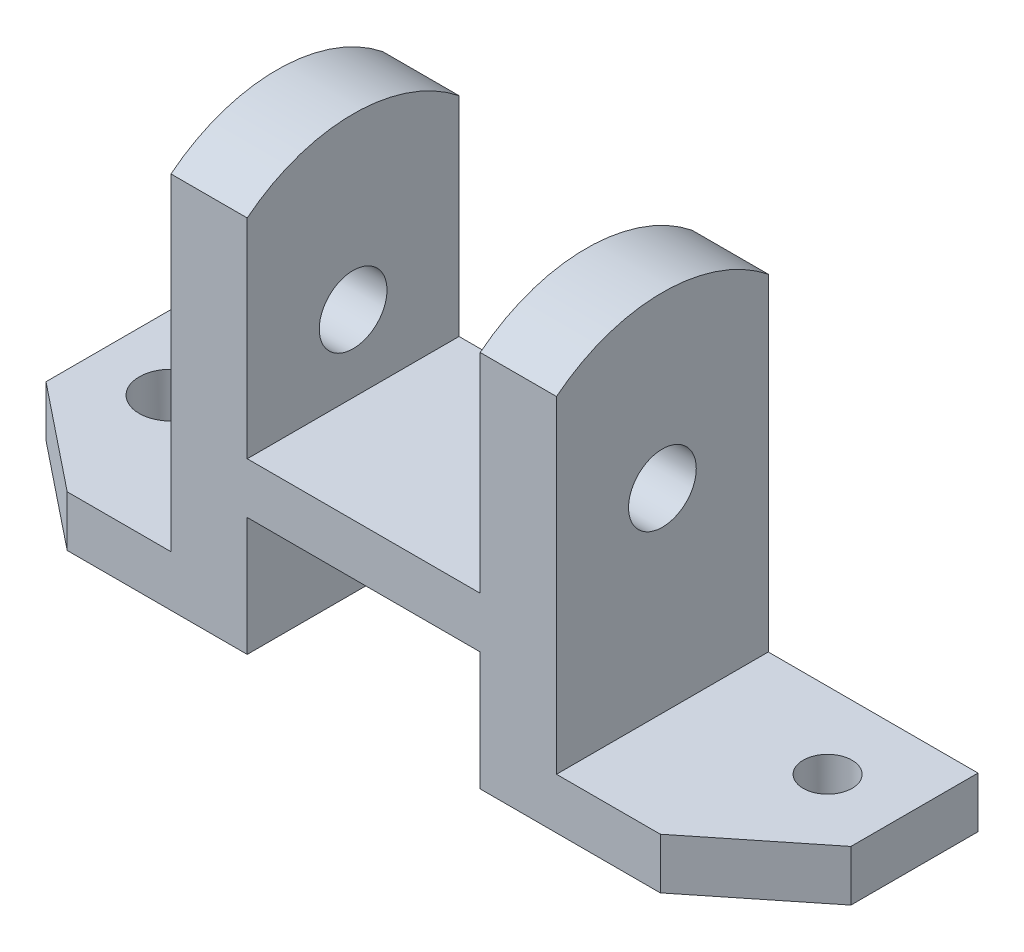
ISO-10303-21;
HEADER;
FILE_DESCRIPTION(('STEP AP214'),'2;1');
FILE_NAME('part.step','',(''),(''),'','','');
FILE_SCHEMA(('AUTOMOTIVE_DESIGN { 1 0 10303 214 1 1 1 1 }'));
ENDSEC;
DATA;
#1=APPLICATION_CONTEXT('core data for automotive mechanical design processes');
#2=APPLICATION_PROTOCOL_DEFINITION('international standard','automotive_design',2000,#1);
#3=PRODUCT_CONTEXT('',#1,'mechanical');
#4=PRODUCT('Part','Part','',(#3));
#5=PRODUCT_RELATED_PRODUCT_CATEGORY('part','',(#4));
#6=PRODUCT_DEFINITION_FORMATION('','',#4);
#7=PRODUCT_DEFINITION_CONTEXT('part definition',#1,'design');
#8=PRODUCT_DEFINITION('design','',#6,#7);
#9=PRODUCT_DEFINITION_SHAPE('','',#8);
#10=(LENGTH_UNIT() NAMED_UNIT(*) SI_UNIT(.MILLI.,.METRE.));
#11=(NAMED_UNIT(*) PLANE_ANGLE_UNIT() SI_UNIT($,.RADIAN.));
#12=(NAMED_UNIT(*) SI_UNIT($,.STERADIAN.) SOLID_ANGLE_UNIT());
#13=UNCERTAINTY_MEASURE_WITH_UNIT(LENGTH_MEASURE(1.E-05),#10,'distance_accuracy_value','');
#14=(GEOMETRIC_REPRESENTATION_CONTEXT(3) GLOBAL_UNCERTAINTY_ASSIGNED_CONTEXT((#13)) GLOBAL_UNIT_ASSIGNED_CONTEXT((#10,
#11,#12)) REPRESENTATION_CONTEXT('',''));
#15=CARTESIAN_POINT('',(0.,0.,0.));
#16=DIRECTION('',(0.,0.,1.));
#17=DIRECTION('',(1.,0.,0.));
#18=AXIS2_PLACEMENT_3D('',#15,#16,#17);
#19=CARTESIAN_POINT('',(0.,-12.,0.));
#20=DIRECTION('',(0.,1.,0.));
#21=DIRECTION('',(0.,0.,1.));
#22=AXIS2_PLACEMENT_3D('',#19,#20,#21);
#23=PLANE('',#22);
#24=DIRECTION('',(1.,0.,0.));
#25=VECTOR('',#24,1.);
#26=CARTESIAN_POINT('',(-27.5,-12.,-11.));
#27=LINE('',#26,#25);
#28=CARTESIAN_POINT('',(-27.5,-12.,-11.));
#29=VERTEX_POINT('',#28);
#30=CARTESIAN_POINT('',(27.5,-12.,-11.));
#31=VERTEX_POINT('',#30);
#32=EDGE_CURVE('E448',#29,#31,#27,.T.);
#33=ORIENTED_EDGE('',*,*,#32,.F.);
#34=DIRECTION('',(0.,0.,1.));
#35=VECTOR('',#34,1.);
#36=CARTESIAN_POINT('',(-27.5,-12.,25.));
#37=LINE('',#36,#35);
#38=CARTESIAN_POINT('',(-27.5,-12.,-25.));
#39=VERTEX_POINT('',#38);
#40=EDGE_CURVE('E213',#39,#29,#37,.T.);
#41=ORIENTED_EDGE('',*,*,#40,.F.);
#42=DIRECTION('',(-1.,0.,0.));
#43=VECTOR('',#42,1.);
#44=CARTESIAN_POINT('',(-45.5,-12.,-25.));
#45=LINE('',#44,#43);
#46=CARTESIAN_POINT('',(27.5,-12.,-25.));
#47=VERTEX_POINT('',#46);
#48=EDGE_CURVE('E245',#47,#39,#45,.T.);
#49=ORIENTED_EDGE('',*,*,#48,.F.);
#50=DIRECTION('',(0.,0.,-1.));
#51=VECTOR('',#50,1.);
#52=CARTESIAN_POINT('',(27.5,-12.,25.));
#53=LINE('',#52,#51);
#54=EDGE_CURVE('E425',#31,#47,#53,.T.);
#55=ORIENTED_EDGE('',*,*,#54,.F.);
#56=EDGE_LOOP('',(#33,#41,#49,#55));
#57=FACE_BOUND('',#56,.T.);
#58=ADVANCED_FACE('F43',(#57),#23,.F.);
#59=DIRECTION('',(-1.,0.,0.));
#60=VECTOR('',#59,1.);
#61=CARTESIAN_POINT('',(-27.5,-12.,-3.));
#62=LINE('',#61,#60);
#63=CARTESIAN_POINT('',(27.5,-12.,-3.));
#64=VERTEX_POINT('',#63);
#65=CARTESIAN_POINT('',(-27.5,-12.,-3.));
#66=VERTEX_POINT('',#65);
#67=EDGE_CURVE('E204',#64,#66,#62,.T.);
#68=ORIENTED_EDGE('',*,*,#67,.F.);
#69=CARTESIAN_POINT('',(27.5,-12.,25.));
#70=VERTEX_POINT('',#69);
#71=EDGE_CURVE('E421',#70,#64,#53,.T.);
#72=ORIENTED_EDGE('',*,*,#71,.F.);
#73=DIRECTION('',(1.,0.,0.));
#74=VECTOR('',#73,1.);
#75=CARTESIAN_POINT('',(-45.5,-12.,25.));
#76=LINE('',#75,#74);
#77=CARTESIAN_POINT('',(-27.5,-12.,25.));
#78=VERTEX_POINT('',#77);
#79=EDGE_CURVE('E248',#78,#70,#76,.T.);
#80=ORIENTED_EDGE('',*,*,#79,.F.);
#81=EDGE_CURVE('E237',#66,#78,#37,.T.);
#82=ORIENTED_EDGE('',*,*,#81,.F.);
#83=EDGE_LOOP('',(#68,#72,#80,#82));
#84=FACE_BOUND('',#83,.T.);
#85=ADVANCED_FACE('F515',(#84),#23,.F.);
#86=CARTESIAN_POINT('',(-27.5,-40.,25.));
#87=DIRECTION('',(-1.,0.,0.));
#88=DIRECTION('',(0.,0.,1.));
#89=AXIS2_PLACEMENT_3D('',#86,#87,#88);
#90=PLANE('',#89);
#91=DIRECTION('',(0.,1.,0.));
#92=VECTOR('',#91,1.);
#93=CARTESIAN_POINT('',(-27.5,-40.,-11.));
#94=LINE('',#93,#92);
#95=CARTESIAN_POINT('',(-27.5,-40.,-11.));
#96=VERTEX_POINT('',#95);
#97=EDGE_CURVE('E197',#96,#29,#94,.T.);
#98=ORIENTED_EDGE('',*,*,#97,.F.);
#99=DIRECTION('',(0.,0.,1.));
#100=VECTOR('',#99,1.);
#101=CARTESIAN_POINT('',(-27.5,-40.,25.));
#102=LINE('',#101,#100);
#103=CARTESIAN_POINT('',(-27.5,-40.,-25.));
#104=VERTEX_POINT('',#103);
#105=EDGE_CURVE('E211',#104,#96,#102,.T.);
#106=ORIENTED_EDGE('',*,*,#105,.F.);
#107=DIRECTION('',(0.,1.,0.));
#108=VECTOR('',#107,1.);
#109=CARTESIAN_POINT('',(-27.5,-40.,-25.));
#110=LINE('',#109,#108);
#111=EDGE_CURVE('E241',#104,#39,#110,.T.);
#112=ORIENTED_EDGE('',*,*,#111,.T.);
#113=ORIENTED_EDGE('',*,*,#40,.T.);
#114=EDGE_LOOP('',(#98,#106,#112,#113));
#115=FACE_BOUND('',#114,.T.);
#116=ADVANCED_FACE('F209',(#115),#90,.F.);
#117=DIRECTION('',(0.,1.,0.));
#118=VECTOR('',#117,1.);
#119=CARTESIAN_POINT('',(-27.5,-40.,-3.));
#120=LINE('',#119,#118);
#121=CARTESIAN_POINT('',(-27.5,-40.,-3.));
#122=VERTEX_POINT('',#121);
#123=EDGE_CURVE('E874',#122,#66,#120,.T.);
#124=ORIENTED_EDGE('',*,*,#123,.T.);
#125=ORIENTED_EDGE('',*,*,#81,.T.);
#126=DIRECTION('',(0.,1.,0.));
#127=VECTOR('',#126,1.);
#128=CARTESIAN_POINT('',(-27.5,-40.,25.));
#129=LINE('',#128,#127);
#130=CARTESIAN_POINT('',(-27.5,-40.,25.));
#131=VERTEX_POINT('',#130);
#132=EDGE_CURVE('E230',#131,#78,#129,.T.);
#133=ORIENTED_EDGE('',*,*,#132,.F.);
#134=EDGE_CURVE('E225',#122,#131,#102,.T.);
#135=ORIENTED_EDGE('',*,*,#134,.F.);
#136=EDGE_LOOP('',(#124,#125,#133,#135));
#137=FACE_BOUND('',#136,.T.);
#138=ADVANCED_FACE('F677',(#137),#90,.F.);
#139=CARTESIAN_POINT('',(27.5,-40.,25.));
#140=DIRECTION('',(1.,0.,0.));
#141=DIRECTION('',(0.,0.,-1.));
#142=AXIS2_PLACEMENT_3D('',#139,#140,#141);
#143=PLANE('',#142);
#144=DIRECTION('',(0.,1.,0.));
#145=VECTOR('',#144,1.);
#146=CARTESIAN_POINT('',(27.5,-40.,-11.));
#147=LINE('',#146,#145);
#148=CARTESIAN_POINT('',(27.5,-40.,-11.));
#149=VERTEX_POINT('',#148);
#150=EDGE_CURVE('E61',#149,#31,#147,.T.);
#151=ORIENTED_EDGE('',*,*,#150,.T.);
#152=ORIENTED_EDGE('',*,*,#54,.T.);
#153=DIRECTION('',(0.,1.,0.));
#154=VECTOR('',#153,1.);
#155=CARTESIAN_POINT('',(27.5,-40.,-25.));
#156=LINE('',#155,#154);
#157=CARTESIAN_POINT('',(27.5,-40.,-25.));
#158=VERTEX_POINT('',#157);
#159=EDGE_CURVE('E416',#158,#47,#156,.T.);
#160=ORIENTED_EDGE('',*,*,#159,.F.);
#161=DIRECTION('',(0.,0.,-1.));
#162=VECTOR('',#161,1.);
#163=CARTESIAN_POINT('',(27.5,-40.,25.));
#164=LINE('',#163,#162);
#165=EDGE_CURVE('E429',#149,#158,#164,.T.);
#166=ORIENTED_EDGE('',*,*,#165,.F.);
#167=EDGE_LOOP('',(#151,#152,#160,#166));
#168=FACE_BOUND('',#167,.T.);
#169=ADVANCED_FACE('F441',(#168),#143,.F.);
#170=DIRECTION('',(0.,1.,0.));
#171=VECTOR('',#170,1.);
#172=CARTESIAN_POINT('',(27.5,-40.,-3.));
#173=LINE('',#172,#171);
#174=CARTESIAN_POINT('',(27.5,-40.,-3.));
#175=VERTEX_POINT('',#174);
#176=EDGE_CURVE('E870',#175,#64,#173,.T.);
#177=ORIENTED_EDGE('',*,*,#176,.F.);
#178=CARTESIAN_POINT('',(27.5,-40.,25.));
#179=VERTEX_POINT('',#178);
#180=EDGE_CURVE('E430',#179,#175,#164,.T.);
#181=ORIENTED_EDGE('',*,*,#180,.F.);
#182=DIRECTION('',(0.,1.,0.));
#183=VECTOR('',#182,1.);
#184=CARTESIAN_POINT('',(27.5,-40.,25.));
#185=LINE('',#184,#183);
#186=EDGE_CURVE('E413',#179,#70,#185,.T.);
#187=ORIENTED_EDGE('',*,*,#186,.T.);
#188=ORIENTED_EDGE('',*,*,#71,.T.);
#189=EDGE_LOOP('',(#177,#181,#187,#188));
#190=FACE_BOUND('',#189,.T.);
#191=ADVANCED_FACE('F693',(#190),#143,.F.);
#192=CARTESIAN_POINT('',(45.5,-12.,-25.));
#193=DIRECTION('',(1.,0.,0.));
#194=DIRECTION('',(0.,0.,-1.));
#195=AXIS2_PLACEMENT_3D('',#192,#193,#194);
#196=PLANE('',#195);
#197=CARTESIAN_POINT('',(45.5,18.,0.));
#198=DIRECTION('',(1.,0.,0.));
#199=DIRECTION('',(0.,0.,-1.));
#200=AXIS2_PLACEMENT_3D('',#197,#198,#199);
#201=CIRCLE('',#200,8.);
#202=CARTESIAN_POINT('',(45.5,18.,-8.));
#203=VERTEX_POINT('',#202);
#204=EDGE_CURVE('E284',#203,#203,#201,.T.);
#205=ORIENTED_EDGE('',*,*,#204,.F.);
#206=EDGE_LOOP('',(#205));
#207=FACE_BOUND('',#206,.T.);
#208=CARTESIAN_POINT('',(45.5,18.,0.));
#209=DIRECTION('',(1.,0.,0.));
#210=DIRECTION('',(0.,0.,-1.));
#211=AXIS2_PLACEMENT_3D('',#208,#209,#210);
#212=CIRCLE('',#211,40.);
#213=CARTESIAN_POINT('',(45.5,49.224989991992,-25.));
#214=VERTEX_POINT('',#213);
#215=CARTESIAN_POINT('',(45.5,49.224989991992,25.));
#216=VERTEX_POINT('',#215);
#217=EDGE_CURVE('E307',#214,#216,#212,.T.);
#218=ORIENTED_EDGE('',*,*,#217,.T.);
#219=DIRECTION('',(0.,1.,0.));
#220=VECTOR('',#219,1.);
#221=CARTESIAN_POINT('',(45.5,-12.,25.));
#222=LINE('',#221,#220);
#223=CARTESIAN_POINT('',(45.5,-28.,25.));
#224=VERTEX_POINT('',#223);
#225=EDGE_CURVE('E11',#224,#216,#222,.T.);
#226=ORIENTED_EDGE('',*,*,#225,.F.);
#227=DIRECTION('',(0.,0.,1.));
#228=VECTOR('',#227,1.);
#229=CARTESIAN_POINT('',(45.5,-28.,25.));
#230=LINE('',#229,#228);
#231=CARTESIAN_POINT('',(45.5,-28.,-25.));
#232=VERTEX_POINT('',#231);
#233=EDGE_CURVE('E392',#232,#224,#230,.T.);
#234=ORIENTED_EDGE('',*,*,#233,.F.);
#235=DIRECTION('',(0.,1.,0.));
#236=VECTOR('',#235,1.);
#237=CARTESIAN_POINT('',(45.5,-12.,-25.));
#238=LINE('',#237,#236);
#239=EDGE_CURVE('E253',#232,#214,#238,.T.);
#240=ORIENTED_EDGE('',*,*,#239,.T.);
#241=EDGE_LOOP('',(#218,#226,#234,#240));
#242=FACE_BOUND('',#241,.T.);
#243=ADVANCED_FACE('F45',(#207,#242),#196,.T.);
#244=CARTESIAN_POINT('',(-45.5,-12.,-25.));
#245=DIRECTION('',(-1.,0.,0.));
#246=DIRECTION('',(0.,0.,1.));
#247=AXIS2_PLACEMENT_3D('',#244,#245,#246);
#248=PLANE('',#247);
#249=CARTESIAN_POINT('',(-45.5,18.,0.));
#250=DIRECTION('',(-1.,0.,0.));
#251=DIRECTION('',(0.,0.,1.));
#252=AXIS2_PLACEMENT_3D('',#249,#250,#251);
#253=CIRCLE('',#252,8.);
#254=CARTESIAN_POINT('',(-45.5,18.,8.));
#255=VERTEX_POINT('',#254);
#256=EDGE_CURVE('E303',#255,#255,#253,.T.);
#257=ORIENTED_EDGE('',*,*,#256,.F.);
#258=EDGE_LOOP('',(#257));
#259=FACE_BOUND('',#258,.T.);
#260=DIRECTION('',(0.,1.,0.));
#261=VECTOR('',#260,1.);
#262=CARTESIAN_POINT('',(-45.5,-12.,25.));
#263=LINE('',#262,#261);
#264=CARTESIAN_POINT('',(-45.5,-28.,25.));
#265=VERTEX_POINT('',#264);
#266=CARTESIAN_POINT('',(-45.5,49.224989991992,25.));
#267=VERTEX_POINT('',#266);
#268=EDGE_CURVE('E53',#265,#267,#263,.T.);
#269=ORIENTED_EDGE('',*,*,#268,.T.);
#270=CARTESIAN_POINT('',(-45.5,18.,0.));
#271=DIRECTION('',(-1.,0.,0.));
#272=DIRECTION('',(0.,0.,1.));
#273=AXIS2_PLACEMENT_3D('',#270,#271,#272);
#274=CIRCLE('',#273,40.);
#275=CARTESIAN_POINT('',(-45.5,49.224989991992,-25.));
#276=VERTEX_POINT('',#275);
#277=EDGE_CURVE('E321',#267,#276,#274,.T.);
#278=ORIENTED_EDGE('',*,*,#277,.T.);
#279=DIRECTION('',(0.,1.,0.));
#280=VECTOR('',#279,1.);
#281=CARTESIAN_POINT('',(-45.5,-12.,-25.));
#282=LINE('',#281,#280);
#283=CARTESIAN_POINT('',(-45.5,-28.,-25.));
#284=VERTEX_POINT('',#283);
#285=EDGE_CURVE('E263',#284,#276,#282,.T.);
#286=ORIENTED_EDGE('',*,*,#285,.F.);
#287=DIRECTION('',(0.,0.,-1.));
#288=VECTOR('',#287,1.);
#289=CARTESIAN_POINT('',(-45.5,-28.,-25.));
#290=LINE('',#289,#288);
#291=EDGE_CURVE('E368',#265,#284,#290,.T.);
#292=ORIENTED_EDGE('',*,*,#291,.F.);
#293=EDGE_LOOP('',(#269,#278,#286,#292));
#294=FACE_BOUND('',#293,.T.);
#295=ADVANCED_FACE('F462',(#259,#294),#248,.T.);
#296=CARTESIAN_POINT('',(-27.5,58.,-25.));
#297=DIRECTION('',(-1.,0.,0.));
#298=DIRECTION('',(0.,0.,1.));
#299=AXIS2_PLACEMENT_3D('',#296,#297,#298);
#300=PLANE('',#299);
#301=CARTESIAN_POINT('',(-27.5,18.,0.));
#302=DIRECTION('',(-1.,0.,0.));
#303=DIRECTION('',(0.,0.,1.));
#304=AXIS2_PLACEMENT_3D('',#301,#302,#303);
#305=CIRCLE('',#304,8.);
#306=CARTESIAN_POINT('',(-27.5,18.,8.));
#307=VERTEX_POINT('',#306);
#308=EDGE_CURVE('E273',#307,#307,#305,.T.);
#309=ORIENTED_EDGE('',*,*,#308,.T.);
#310=EDGE_LOOP('',(#309));
#311=FACE_BOUND('',#310,.T.);
#312=CARTESIAN_POINT('',(-27.5,18.,0.));
#313=DIRECTION('',(-1.,0.,0.));
#314=DIRECTION('',(0.,0.,1.));
#315=AXIS2_PLACEMENT_3D('',#312,#313,#314);
#316=CIRCLE('',#315,40.);
#317=CARTESIAN_POINT('',(-27.5,49.224989991992,25.));
#318=VERTEX_POINT('',#317);
#319=CARTESIAN_POINT('',(-27.5,49.224989991992,-25.));
#320=VERTEX_POINT('',#319);
#321=EDGE_CURVE('E318',#318,#320,#316,.T.);
#322=ORIENTED_EDGE('',*,*,#321,.F.);
#323=DIRECTION('',(0.,-1.,0.));
#324=VECTOR('',#323,1.);
#325=CARTESIAN_POINT('',(-27.5,58.,25.));
#326=LINE('',#325,#324);
#327=CARTESIAN_POINT('',(-27.5,0.,25.));
#328=VERTEX_POINT('',#327);
#329=EDGE_CURVE('E340',#318,#328,#326,.T.);
#330=ORIENTED_EDGE('',*,*,#329,.T.);
#331=DIRECTION('',(0.,0.,-1.));
#332=VECTOR('',#331,1.);
#333=CARTESIAN_POINT('',(-27.5,0.,-25.));
#334=LINE('',#333,#332);
#335=CARTESIAN_POINT('',(-27.5,0.,-25.));
#336=VERTEX_POINT('',#335);
#337=EDGE_CURVE('E333',#328,#336,#334,.T.);
#338=ORIENTED_EDGE('',*,*,#337,.T.);
#339=DIRECTION('',(0.,-1.,0.));
#340=VECTOR('',#339,1.);
#341=CARTESIAN_POINT('',(-27.5,58.,-25.));
#342=LINE('',#341,#340);
#343=EDGE_CURVE('E337',#320,#336,#342,.T.);
#344=ORIENTED_EDGE('',*,*,#343,.F.);
#345=EDGE_LOOP('',(#322,#330,#338,#344));
#346=FACE_BOUND('',#345,.T.);
#347=ADVANCED_FACE('F501',(#311,#346),#300,.F.);
#348=CARTESIAN_POINT('',(27.5,58.,-25.));
#349=DIRECTION('',(1.,0.,0.));
#350=DIRECTION('',(0.,0.,-1.));
#351=AXIS2_PLACEMENT_3D('',#348,#349,#350);
#352=PLANE('',#351);
#353=CARTESIAN_POINT('',(27.5,18.,0.));
#354=DIRECTION('',(1.,0.,0.));
#355=DIRECTION('',(0.,0.,-1.));
#356=AXIS2_PLACEMENT_3D('',#353,#354,#355);
#357=CIRCLE('',#356,8.);
#358=CARTESIAN_POINT('',(27.5,18.,-8.));
#359=VERTEX_POINT('',#358);
#360=EDGE_CURVE('E270',#359,#359,#357,.T.);
#361=ORIENTED_EDGE('',*,*,#360,.T.);
#362=EDGE_LOOP('',(#361));
#363=FACE_BOUND('',#362,.T.);
#364=DIRECTION('',(0.,-1.,0.));
#365=VECTOR('',#364,1.);
#366=CARTESIAN_POINT('',(27.5,58.,25.));
#367=LINE('',#366,#365);
#368=CARTESIAN_POINT('',(27.5,49.224989991992,25.));
#369=VERTEX_POINT('',#368);
#370=CARTESIAN_POINT('',(27.5,0.,25.));
#371=VERTEX_POINT('',#370);
#372=EDGE_CURVE('E327',#369,#371,#367,.T.);
#373=ORIENTED_EDGE('',*,*,#372,.F.);
#374=CARTESIAN_POINT('',(27.5,18.,0.));
#375=DIRECTION('',(1.,0.,0.));
#376=DIRECTION('',(0.,0.,-1.));
#377=AXIS2_PLACEMENT_3D('',#374,#375,#376);
#378=CIRCLE('',#377,40.);
#379=CARTESIAN_POINT('',(27.5,49.224989991992,-25.));
#380=VERTEX_POINT('',#379);
#381=EDGE_CURVE('E315',#380,#369,#378,.T.);
#382=ORIENTED_EDGE('',*,*,#381,.F.);
#383=DIRECTION('',(0.,-1.,0.));
#384=VECTOR('',#383,1.);
#385=CARTESIAN_POINT('',(27.5,58.,-25.));
#386=LINE('',#385,#384);
#387=CARTESIAN_POINT('',(27.5,0.,-25.));
#388=VERTEX_POINT('',#387);
#389=EDGE_CURVE('E69',#380,#388,#386,.T.);
#390=ORIENTED_EDGE('',*,*,#389,.T.);
#391=DIRECTION('',(0.,0.,1.));
#392=VECTOR('',#391,1.);
#393=CARTESIAN_POINT('',(27.5,0.,-25.));
#394=LINE('',#393,#392);
#395=EDGE_CURVE('E330',#388,#371,#394,.T.);
#396=ORIENTED_EDGE('',*,*,#395,.T.);
#397=EDGE_LOOP('',(#373,#382,#390,#396));
#398=FACE_BOUND('',#397,.T.);
#399=ADVANCED_FACE('F495',(#363,#398),#352,.F.);
#400=CARTESIAN_POINT('',(-45.5,-12.,25.));
#401=DIRECTION('',(0.,0.,1.));
#402=DIRECTION('',(1.,0.,0.));
#403=AXIS2_PLACEMENT_3D('',#400,#401,#402);
#404=PLANE('',#403);
#405=ORIENTED_EDGE('',*,*,#225,.T.);
#406=DIRECTION('',(1.,0.,0.));
#407=VECTOR('',#406,1.);
#408=CARTESIAN_POINT('',(-95.,49.224989991992,25.));
#409=LINE('',#408,#407);
#410=EDGE_CURVE('E293',#369,#216,#409,.T.);
#411=ORIENTED_EDGE('',*,*,#410,.F.);
#412=ORIENTED_EDGE('',*,*,#372,.T.);
#413=DIRECTION('',(1.,0.,0.));
#414=VECTOR('',#413,1.);
#415=CARTESIAN_POINT('',(-45.5,0.,25.));
#416=LINE('',#415,#414);
#417=EDGE_CURVE('E249',#328,#371,#416,.T.);
#418=ORIENTED_EDGE('',*,*,#417,.F.);
#419=ORIENTED_EDGE('',*,*,#329,.F.);
#420=EDGE_CURVE('E274',#267,#318,#409,.T.);
#421=ORIENTED_EDGE('',*,*,#420,.F.);
#422=ORIENTED_EDGE('',*,*,#268,.F.);
#423=DIRECTION('',(1.,0.,0.));
#424=VECTOR('',#423,1.);
#425=CARTESIAN_POINT('',(-95.,-28.,25.));
#426=LINE('',#425,#424);
#427=CARTESIAN_POINT('',(-70.,-28.,25.));
#428=VERTEX_POINT('',#427);
#429=EDGE_CURVE('E389',#428,#265,#426,.T.);
#430=ORIENTED_EDGE('',*,*,#429,.F.);
#431=DIRECTION('',(0.,1.,0.));
#432=VECTOR('',#431,1.);
#433=CARTESIAN_POINT('',(-70.,-40.,25.));
#434=LINE('',#433,#432);
#435=CARTESIAN_POINT('',(-70.,-40.,25.));
#436=VERTEX_POINT('',#435);
#437=EDGE_CURVE('E347',#436,#428,#434,.T.);
#438=ORIENTED_EDGE('',*,*,#437,.F.);
#439=DIRECTION('',(-1.,0.,0.));
#440=VECTOR('',#439,1.);
#441=CARTESIAN_POINT('',(-45.5,-40.,25.));
#442=LINE('',#441,#440);
#443=EDGE_CURVE('E224',#131,#436,#442,.T.);
#444=ORIENTED_EDGE('',*,*,#443,.F.);
#445=ORIENTED_EDGE('',*,*,#132,.T.);
#446=ORIENTED_EDGE('',*,*,#79,.T.);
#447=ORIENTED_EDGE('',*,*,#186,.F.);
#448=DIRECTION('',(-1.,0.,0.));
#449=VECTOR('',#448,1.);
#450=CARTESIAN_POINT('',(45.5,-40.,25.));
#451=LINE('',#450,#449);
#452=CARTESIAN_POINT('',(70.,-40.,25.));
#453=VERTEX_POINT('',#452);
#454=EDGE_CURVE('E433',#453,#179,#451,.T.);
#455=ORIENTED_EDGE('',*,*,#454,.F.);
#456=DIRECTION('',(0.,1.,0.));
#457=VECTOR('',#456,1.);
#458=CARTESIAN_POINT('',(70.,-40.,25.));
#459=LINE('',#458,#457);
#460=CARTESIAN_POINT('',(70.,-28.,25.));
#461=VERTEX_POINT('',#460);
#462=EDGE_CURVE('E364',#453,#461,#459,.T.);
#463=ORIENTED_EDGE('',*,*,#462,.T.);
#464=DIRECTION('',(-1.,0.,0.));
#465=VECTOR('',#464,1.);
#466=CARTESIAN_POINT('',(95.,-28.,25.));
#467=LINE('',#466,#465);
#468=EDGE_CURVE('E403',#461,#224,#467,.T.);
#469=ORIENTED_EDGE('',*,*,#468,.T.);
#470=EDGE_LOOP('',(#405,#411,#412,#418,#419,#421,#422,#430,#438,#444,#445,#446,#447,#455,#463,#469));
#471=FACE_BOUND('',#470,.T.);
#472=ADVANCED_FACE('F470',(#471),#404,.T.);
#473=CARTESIAN_POINT('',(-45.5,-12.,-25.));
#474=DIRECTION('',(0.,0.,-1.));
#475=DIRECTION('',(-1.,0.,0.));
#476=AXIS2_PLACEMENT_3D('',#473,#474,#475);
#477=PLANE('',#476);
#478=ORIENTED_EDGE('',*,*,#285,.T.);
#479=DIRECTION('',(1.,0.,0.));
#480=VECTOR('',#479,1.);
#481=CARTESIAN_POINT('',(-95.,49.224989991992,-25.));
#482=LINE('',#481,#480);
#483=EDGE_CURVE('E314',#276,#320,#482,.T.);
#484=ORIENTED_EDGE('',*,*,#483,.T.);
#485=ORIENTED_EDGE('',*,*,#343,.T.);
#486=DIRECTION('',(-1.,0.,0.));
#487=VECTOR('',#486,1.);
#488=CARTESIAN_POINT('',(-45.5,0.,-25.));
#489=LINE('',#488,#487);
#490=EDGE_CURVE('E244',#388,#336,#489,.T.);
#491=ORIENTED_EDGE('',*,*,#490,.F.);
#492=ORIENTED_EDGE('',*,*,#389,.F.);
#493=EDGE_CURVE('E310',#380,#214,#482,.T.);
#494=ORIENTED_EDGE('',*,*,#493,.T.);
#495=ORIENTED_EDGE('',*,*,#239,.F.);
#496=DIRECTION('',(-1.,0.,0.));
#497=VECTOR('',#496,1.);
#498=CARTESIAN_POINT('',(95.,-28.,-25.));
#499=LINE('',#498,#497);
#500=CARTESIAN_POINT('',(95.,-28.,-25.));
#501=VERTEX_POINT('',#500);
#502=EDGE_CURVE('E409',#501,#232,#499,.T.);
#503=ORIENTED_EDGE('',*,*,#502,.F.);
#504=DIRECTION('',(0.,1.,0.));
#505=VECTOR('',#504,1.);
#506=CARTESIAN_POINT('',(95.,-40.,-25.));
#507=LINE('',#506,#505);
#508=CARTESIAN_POINT('',(95.,-40.,-25.));
#509=VERTEX_POINT('',#508);
#510=EDGE_CURVE('E396',#509,#501,#507,.T.);
#511=ORIENTED_EDGE('',*,*,#510,.F.);
#512=DIRECTION('',(1.,0.,0.));
#513=VECTOR('',#512,1.);
#514=CARTESIAN_POINT('',(45.5,-40.,-25.));
#515=LINE('',#514,#513);
#516=EDGE_CURVE('E420',#158,#509,#515,.T.);
#517=ORIENTED_EDGE('',*,*,#516,.F.);
#518=ORIENTED_EDGE('',*,*,#159,.T.);
#519=ORIENTED_EDGE('',*,*,#48,.T.);
#520=ORIENTED_EDGE('',*,*,#111,.F.);
#521=DIRECTION('',(1.,0.,0.));
#522=VECTOR('',#521,1.);
#523=CARTESIAN_POINT('',(-45.5,-40.,-25.));
#524=LINE('',#523,#522);
#525=CARTESIAN_POINT('',(-95.,-40.,-25.));
#526=VERTEX_POINT('',#525);
#527=EDGE_CURVE('E221',#526,#104,#524,.T.);
#528=ORIENTED_EDGE('',*,*,#527,.F.);
#529=DIRECTION('',(0.,-1.,0.));
#530=VECTOR('',#529,1.);
#531=CARTESIAN_POINT('',(-95.,-40.,-25.));
#532=LINE('',#531,#530);
#533=CARTESIAN_POINT('',(-95.,-28.,-25.));
#534=VERTEX_POINT('',#533);
#535=EDGE_CURVE('E371',#534,#526,#532,.T.);
#536=ORIENTED_EDGE('',*,*,#535,.F.);
#537=DIRECTION('',(1.,0.,0.));
#538=VECTOR('',#537,1.);
#539=CARTESIAN_POINT('',(-95.,-28.,-25.));
#540=LINE('',#539,#538);
#541=EDGE_CURVE('E382',#534,#284,#540,.T.);
#542=ORIENTED_EDGE('',*,*,#541,.T.);
#543=EDGE_LOOP('',(#478,#484,#485,#491,#492,#494,#495,#503,#511,#517,#518,#519,#520,#528,#536,#542));
#544=FACE_BOUND('',#543,.T.);
#545=ADVANCED_FACE('F446',(#544),#477,.T.);
#546=CARTESIAN_POINT('',(0.,0.,0.));
#547=DIRECTION('',(0.,1.,0.));
#548=DIRECTION('',(0.,0.,1.));
#549=AXIS2_PLACEMENT_3D('',#546,#547,#548);
#550=PLANE('',#549);
#551=ORIENTED_EDGE('',*,*,#417,.T.);
#552=ORIENTED_EDGE('',*,*,#395,.F.);
#553=ORIENTED_EDGE('',*,*,#490,.T.);
#554=ORIENTED_EDGE('',*,*,#337,.F.);
#555=EDGE_LOOP('',(#551,#552,#553,#554));
#556=FACE_BOUND('',#555,.T.);
#557=ADVANCED_FACE('F498',(#556),#550,.T.);
#558=CARTESIAN_POINT('',(0.,-40.,0.));
#559=DIRECTION('',(0.,-1.,0.));
#560=DIRECTION('',(0.,0.,-1.));
#561=AXIS2_PLACEMENT_3D('',#558,#559,#560);
#562=PLANE('',#561);
#563=CARTESIAN_POINT('',(-77.5,-40.,-7.));
#564=DIRECTION('',(0.,1.,0.));
#565=DIRECTION('',(0.,0.,1.));
#566=AXIS2_PLACEMENT_3D('',#563,#564,#565);
#567=CIRCLE('',#566,7.5);
#568=CARTESIAN_POINT('',(-77.5,-40.,0.5));
#569=VERTEX_POINT('',#568);
#570=EDGE_CURVE('E215',#569,#569,#567,.T.);
#571=ORIENTED_EDGE('',*,*,#570,.T.);
#572=EDGE_LOOP('',(#571));
#573=FACE_BOUND('',#572,.T.);
#574=DIRECTION('',(-0.78086880944303,0.,-0.624695047554424));
#575=VECTOR('',#574,1.);
#576=CARTESIAN_POINT('',(-95.,-40.,5.));
#577=LINE('',#576,#575);
#578=CARTESIAN_POINT('',(-95.,-40.,5.));
#579=VERTEX_POINT('',#578);
#580=EDGE_CURVE('E344',#436,#579,#577,.T.);
#581=ORIENTED_EDGE('',*,*,#580,.T.);
#582=DIRECTION('',(0.,0.,1.));
#583=VECTOR('',#582,1.);
#584=CARTESIAN_POINT('',(-95.,-40.,-25.));
#585=LINE('',#584,#583);
#586=EDGE_CURVE('E375',#526,#579,#585,.T.);
#587=ORIENTED_EDGE('',*,*,#586,.F.);
#588=ORIENTED_EDGE('',*,*,#527,.T.);
#589=ORIENTED_EDGE('',*,*,#105,.T.);
#590=DIRECTION('',(1.,0.,0.));
#591=VECTOR('',#590,1.);
#592=CARTESIAN_POINT('',(-27.5,-40.,-11.));
#593=LINE('',#592,#591);
#594=EDGE_CURVE('E194',#96,#149,#593,.T.);
#595=ORIENTED_EDGE('',*,*,#594,.T.);
#596=ORIENTED_EDGE('',*,*,#165,.T.);
#597=ORIENTED_EDGE('',*,*,#516,.T.);
#598=DIRECTION('',(0.,0.,-1.));
#599=VECTOR('',#598,1.);
#600=CARTESIAN_POINT('',(95.,-40.,25.));
#601=LINE('',#600,#599);
#602=CARTESIAN_POINT('',(95.,-40.,5.));
#603=VERTEX_POINT('',#602);
#604=EDGE_CURVE('E393',#603,#509,#601,.T.);
#605=ORIENTED_EDGE('',*,*,#604,.F.);
#606=DIRECTION('',(-0.78086880944303,0.,0.624695047554424));
#607=VECTOR('',#606,1.);
#608=CARTESIAN_POINT('',(95.,-40.,5.));
#609=LINE('',#608,#607);
#610=EDGE_CURVE('E357',#603,#453,#609,.T.);
#611=ORIENTED_EDGE('',*,*,#610,.T.);
#612=ORIENTED_EDGE('',*,*,#454,.T.);
#613=ORIENTED_EDGE('',*,*,#180,.T.);
#614=DIRECTION('',(-1.,0.,0.));
#615=VECTOR('',#614,1.);
#616=CARTESIAN_POINT('',(-27.5,-40.,-3.));
#617=LINE('',#616,#615);
#618=EDGE_CURVE('E203',#175,#122,#617,.T.);
#619=ORIENTED_EDGE('',*,*,#618,.T.);
#620=ORIENTED_EDGE('',*,*,#134,.T.);
#621=ORIENTED_EDGE('',*,*,#443,.T.);
#622=EDGE_LOOP('',(#581,#587,#588,#589,#595,#596,#597,#605,#611,#612,#613,#619,#620,#621));
#623=FACE_BOUND('',#622,.T.);
#624=CARTESIAN_POINT('',(77.5,-40.,-7.));
#625=DIRECTION('',(0.,1.,0.));
#626=DIRECTION('',(0.,0.,1.));
#627=AXIS2_PLACEMENT_3D('',#624,#625,#626);
#628=CIRCLE('',#627,5.76905346522427);
#629=CARTESIAN_POINT('',(77.5,-40.,-1.23094653477573));
#630=VERTEX_POINT('',#629);
#631=EDGE_CURVE('E278',#630,#630,#628,.T.);
#632=ORIENTED_EDGE('',*,*,#631,.T.);
#633=EDGE_LOOP('',(#632));
#634=FACE_BOUND('',#633,.T.);
#635=ADVANCED_FACE('F218',(#573,#623,#634),#562,.T.);
#636=CARTESIAN_POINT('',(95.,-28.,25.));
#637=DIRECTION('',(0.,-1.,0.));
#638=DIRECTION('',(0.,0.,-1.));
#639=AXIS2_PLACEMENT_3D('',#636,#637,#638);
#640=PLANE('',#639);
#641=CARTESIAN_POINT('',(77.5,-28.,-7.));
#642=DIRECTION('',(0.,-1.,0.));
#643=DIRECTION('',(0.,0.,-1.));
#644=AXIS2_PLACEMENT_3D('',#641,#642,#643);
#645=CIRCLE('',#644,5.76905346522427);
#646=CARTESIAN_POINT('',(77.5,-28.,-12.7690534652243));
#647=VERTEX_POINT('',#646);
#648=EDGE_CURVE('E47',#647,#647,#645,.T.);
#649=ORIENTED_EDGE('',*,*,#648,.T.);
#650=EDGE_LOOP('',(#649));
#651=FACE_BOUND('',#650,.T.);
#652=ORIENTED_EDGE('',*,*,#468,.F.);
#653=DIRECTION('',(-0.78086880944303,0.,0.624695047554424));
#654=VECTOR('',#653,1.);
#655=CARTESIAN_POINT('',(95.,-28.,5.));
#656=LINE('',#655,#654);
#657=CARTESIAN_POINT('',(95.,-28.,5.));
#658=VERTEX_POINT('',#657);
#659=EDGE_CURVE('E354',#658,#461,#656,.T.);
#660=ORIENTED_EDGE('',*,*,#659,.F.);
#661=DIRECTION('',(0.,0.,1.));
#662=VECTOR('',#661,1.);
#663=CARTESIAN_POINT('',(95.,-28.,25.));
#664=LINE('',#663,#662);
#665=EDGE_CURVE('E399',#501,#658,#664,.T.);
#666=ORIENTED_EDGE('',*,*,#665,.F.);
#667=ORIENTED_EDGE('',*,*,#502,.T.);
#668=ORIENTED_EDGE('',*,*,#233,.T.);
#669=EDGE_LOOP('',(#652,#660,#666,#667,#668));
#670=FACE_BOUND('',#669,.T.);
#671=ADVANCED_FACE('F488',(#651,#670),#640,.F.);
#672=CARTESIAN_POINT('',(95.,0.,0.));
#673=DIRECTION('',(-1.,0.,0.));
#674=DIRECTION('',(0.,0.,1.));
#675=AXIS2_PLACEMENT_3D('',#672,#673,#674);
#676=PLANE('',#675);
#677=ORIENTED_EDGE('',*,*,#665,.T.);
#678=DIRECTION('',(0.,1.,0.));
#679=VECTOR('',#678,1.);
#680=CARTESIAN_POINT('',(95.,-40.,5.));
#681=LINE('',#680,#679);
#682=EDGE_CURVE('E361',#603,#658,#681,.T.);
#683=ORIENTED_EDGE('',*,*,#682,.F.);
#684=ORIENTED_EDGE('',*,*,#604,.T.);
#685=ORIENTED_EDGE('',*,*,#510,.T.);
#686=EDGE_LOOP('',(#677,#683,#684,#685));
#687=FACE_BOUND('',#686,.T.);
#688=ADVANCED_FACE('F481',(#687),#676,.F.);
#689=CARTESIAN_POINT('',(-95.,-28.,-25.));
#690=DIRECTION('',(0.,-1.,0.));
#691=DIRECTION('',(0.,0.,-1.));
#692=AXIS2_PLACEMENT_3D('',#689,#690,#691);
#693=PLANE('',#692);
#694=CARTESIAN_POINT('',(-77.5,-28.,-7.));
#695=DIRECTION('',(0.,-1.,0.));
#696=DIRECTION('',(0.,0.,-1.));
#697=AXIS2_PLACEMENT_3D('',#694,#695,#696);
#698=CIRCLE('',#697,7.5);
#699=CARTESIAN_POINT('',(-77.5,-28.,-14.5));
#700=VERTEX_POINT('',#699);
#701=EDGE_CURVE('E275',#700,#700,#698,.T.);
#702=ORIENTED_EDGE('',*,*,#701,.T.);
#703=EDGE_LOOP('',(#702));
#704=FACE_BOUND('',#703,.T.);
#705=DIRECTION('',(0.,0.,-1.));
#706=VECTOR('',#705,1.);
#707=CARTESIAN_POINT('',(-95.,-28.,-25.));
#708=LINE('',#707,#706);
#709=CARTESIAN_POINT('',(-95.,-28.,5.));
#710=VERTEX_POINT('',#709);
#711=EDGE_CURVE('E379',#710,#534,#708,.T.);
#712=ORIENTED_EDGE('',*,*,#711,.F.);
#713=DIRECTION('',(-0.78086880944303,0.,-0.624695047554424));
#714=VECTOR('',#713,1.);
#715=CARTESIAN_POINT('',(-95.,-28.,5.));
#716=LINE('',#715,#714);
#717=EDGE_CURVE('E343',#428,#710,#716,.T.);
#718=ORIENTED_EDGE('',*,*,#717,.F.);
#719=ORIENTED_EDGE('',*,*,#429,.T.);
#720=ORIENTED_EDGE('',*,*,#291,.T.);
#721=ORIENTED_EDGE('',*,*,#541,.F.);
#722=EDGE_LOOP('',(#712,#718,#719,#720,#721));
#723=FACE_BOUND('',#722,.T.);
#724=ADVANCED_FACE('F457',(#704,#723),#693,.F.);
#725=CARTESIAN_POINT('',(-95.,0.,0.));
#726=DIRECTION('',(1.,0.,0.));
#727=DIRECTION('',(0.,0.,-1.));
#728=AXIS2_PLACEMENT_3D('',#725,#726,#727);
#729=PLANE('',#728);
#730=ORIENTED_EDGE('',*,*,#586,.T.);
#731=DIRECTION('',(0.,1.,0.));
#732=VECTOR('',#731,1.);
#733=CARTESIAN_POINT('',(-95.,-40.,5.));
#734=LINE('',#733,#732);
#735=EDGE_CURVE('E350',#579,#710,#734,.T.);
#736=ORIENTED_EDGE('',*,*,#735,.T.);
#737=ORIENTED_EDGE('',*,*,#711,.T.);
#738=ORIENTED_EDGE('',*,*,#535,.T.);
#739=EDGE_LOOP('',(#730,#736,#737,#738));
#740=FACE_BOUND('',#739,.T.);
#741=ADVANCED_FACE('F452',(#740),#729,.F.);
#742=CARTESIAN_POINT('',(95.,-40.,5.));
#743=DIRECTION('',(-0.624695047554424,0.,-0.78086880944303));
#744=DIRECTION('',(-0.78086880944303,0.,0.624695047554424));
#745=AXIS2_PLACEMENT_3D('',#742,#743,#744);
#746=PLANE('',#745);
#747=ORIENTED_EDGE('',*,*,#659,.T.);
#748=ORIENTED_EDGE('',*,*,#462,.F.);
#749=ORIENTED_EDGE('',*,*,#610,.F.);
#750=ORIENTED_EDGE('',*,*,#682,.T.);
#751=EDGE_LOOP('',(#747,#748,#749,#750));
#752=FACE_BOUND('',#751,.T.);
#753=ADVANCED_FACE('F485',(#752),#746,.F.);
#754=CARTESIAN_POINT('',(-95.,-40.,5.));
#755=DIRECTION('',(0.624695047554424,0.,-0.78086880944303));
#756=DIRECTION('',(-0.78086880944303,0.,-0.624695047554424));
#757=AXIS2_PLACEMENT_3D('',#754,#755,#756);
#758=PLANE('',#757);
#759=ORIENTED_EDGE('',*,*,#717,.T.);
#760=ORIENTED_EDGE('',*,*,#735,.F.);
#761=ORIENTED_EDGE('',*,*,#580,.F.);
#762=ORIENTED_EDGE('',*,*,#437,.T.);
#763=EDGE_LOOP('',(#759,#760,#761,#762));
#764=FACE_BOUND('',#763,.T.);
#765=ADVANCED_FACE('F580',(#764),#758,.F.);
#766=CARTESIAN_POINT('',(-95.,18.,0.));
#767=DIRECTION('',(1.,0.,0.));
#768=DIRECTION('',(0.,0.,-1.));
#769=AXIS2_PLACEMENT_3D('',#766,#767,#768);
#770=CYLINDRICAL_SURFACE('',#769,40.);
#771=ORIENTED_EDGE('',*,*,#381,.T.);
#772=ORIENTED_EDGE('',*,*,#410,.T.);
#773=ORIENTED_EDGE('',*,*,#217,.F.);
#774=ORIENTED_EDGE('',*,*,#493,.F.);
#775=EDGE_LOOP('',(#771,#772,#773,#774));
#776=FACE_BOUND('',#775,.T.);
#777=ADVANCED_FACE('F493',(#776),#770,.T.);
#778=ORIENTED_EDGE('',*,*,#277,.F.);
#779=ORIENTED_EDGE('',*,*,#420,.T.);
#780=ORIENTED_EDGE('',*,*,#321,.T.);
#781=ORIENTED_EDGE('',*,*,#483,.F.);
#782=EDGE_LOOP('',(#778,#779,#780,#781));
#783=FACE_BOUND('',#782,.T.);
#784=ADVANCED_FACE('F467',(#783),#770,.T.);
#785=CARTESIAN_POINT('',(-95.,18.,0.));
#786=DIRECTION('',(1.,0.,0.));
#787=DIRECTION('',(0.,0.,-1.));
#788=AXIS2_PLACEMENT_3D('',#785,#786,#787);
#789=CYLINDRICAL_SURFACE('',#788,8.);
#790=ORIENTED_EDGE('',*,*,#204,.T.);
#791=EDGE_LOOP('',(#790));
#792=FACE_BOUND('',#791,.T.);
#793=ORIENTED_EDGE('',*,*,#360,.F.);
#794=EDGE_LOOP('',(#793));
#795=FACE_BOUND('',#794,.T.);
#796=ADVANCED_FACE('F597',(#792,#795),#789,.F.);
#797=ORIENTED_EDGE('',*,*,#256,.T.);
#798=EDGE_LOOP('',(#797));
#799=FACE_BOUND('',#798,.T.);
#800=ORIENTED_EDGE('',*,*,#308,.F.);
#801=EDGE_LOOP('',(#800));
#802=FACE_BOUND('',#801,.T.);
#803=ADVANCED_FACE('F603',(#799,#802),#789,.F.);
#804=CARTESIAN_POINT('',(-77.5,-40.,-7.));
#805=DIRECTION('',(0.,1.,0.));
#806=DIRECTION('',(0.,0.,1.));
#807=AXIS2_PLACEMENT_3D('',#804,#805,#806);
#808=CYLINDRICAL_SURFACE('',#807,7.5);
#809=ORIENTED_EDGE('',*,*,#570,.F.);
#810=EDGE_LOOP('',(#809));
#811=FACE_BOUND('',#810,.T.);
#812=ORIENTED_EDGE('',*,*,#701,.F.);
#813=EDGE_LOOP('',(#812));
#814=FACE_BOUND('',#813,.T.);
#815=ADVANCED_FACE('F610',(#811,#814),#808,.F.);
#816=CARTESIAN_POINT('',(77.5,-40.,-7.));
#817=DIRECTION('',(0.,1.,0.));
#818=DIRECTION('',(0.,0.,1.));
#819=AXIS2_PLACEMENT_3D('',#816,#817,#818);
#820=CYLINDRICAL_SURFACE('',#819,5.76905346522427);
#821=ORIENTED_EDGE('',*,*,#631,.F.);
#822=EDGE_LOOP('',(#821));
#823=FACE_BOUND('',#822,.T.);
#824=ORIENTED_EDGE('',*,*,#648,.F.);
#825=EDGE_LOOP('',(#824));
#826=FACE_BOUND('',#825,.T.);
#827=ADVANCED_FACE('F616',(#823,#826),#820,.F.);
#828=CARTESIAN_POINT('',(-27.5,-40.,-11.));
#829=DIRECTION('',(0.,0.,1.));
#830=DIRECTION('',(1.,0.,0.));
#831=AXIS2_PLACEMENT_3D('',#828,#829,#830);
#832=PLANE('',#831);
#833=ORIENTED_EDGE('',*,*,#32,.T.);
#834=ORIENTED_EDGE('',*,*,#150,.F.);
#835=ORIENTED_EDGE('',*,*,#594,.F.);
#836=ORIENTED_EDGE('',*,*,#97,.T.);
#837=EDGE_LOOP('',(#833,#834,#835,#836));
#838=FACE_BOUND('',#837,.T.);
#839=ADVANCED_FACE('F196',(#838),#832,.F.);
#840=CARTESIAN_POINT('',(-27.5,-40.,-3.));
#841=DIRECTION('',(0.,0.,-1.));
#842=DIRECTION('',(-1.,0.,0.));
#843=AXIS2_PLACEMENT_3D('',#840,#841,#842);
#844=PLANE('',#843);
#845=ORIENTED_EDGE('',*,*,#67,.T.);
#846=ORIENTED_EDGE('',*,*,#123,.F.);
#847=ORIENTED_EDGE('',*,*,#618,.F.);
#848=ORIENTED_EDGE('',*,*,#176,.T.);
#849=EDGE_LOOP('',(#845,#846,#847,#848));
#850=FACE_BOUND('',#849,.T.);
#851=ADVANCED_FACE('F630',(#850),#844,.F.);
#852=CLOSED_SHELL('',(#58,#85,#116,#138,#169,#191,#243,#295,#347,#399,#472,#545,#557,#635,#671,
#688,#724,#741,#753,#765,#777,#784,#796,#803,#815,#827,#839,#851));
#853=MANIFOLD_SOLID_BREP('B2',#852);
#854=ADVANCED_BREP_SHAPE_REPRESENTATION('',(#18,#853),#14);
#855=SHAPE_DEFINITION_REPRESENTATION(#9,#854);
ENDSEC;
END-ISO-10303-21;
